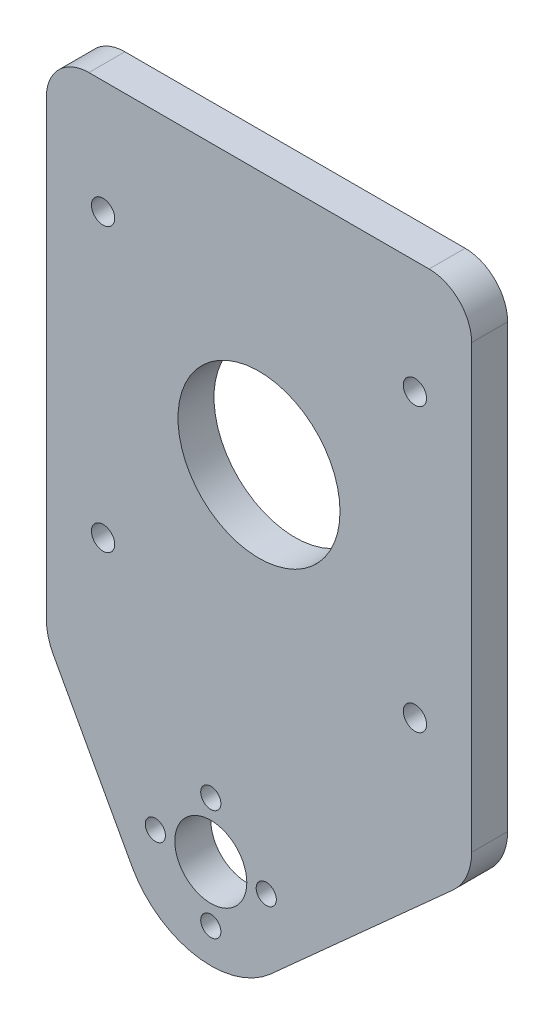
ISO-10303-21;
HEADER;
FILE_DESCRIPTION(('STEP AP214'),'2;1');
FILE_NAME('part.step','',(''),(''),'','','');
FILE_SCHEMA(('AUTOMOTIVE_DESIGN { 1 0 10303 214 1 1 1 1 }'));
ENDSEC;
DATA;
#1=APPLICATION_CONTEXT('core data for automotive mechanical design processes');
#2=APPLICATION_PROTOCOL_DEFINITION('international standard','automotive_design',2000,#1);
#3=PRODUCT_CONTEXT('',#1,'mechanical');
#4=PRODUCT('Part','Part','',(#3));
#5=PRODUCT_RELATED_PRODUCT_CATEGORY('part','',(#4));
#6=PRODUCT_DEFINITION_FORMATION('','',#4);
#7=PRODUCT_DEFINITION_CONTEXT('part definition',#1,'design');
#8=PRODUCT_DEFINITION('design','',#6,#7);
#9=PRODUCT_DEFINITION_SHAPE('','',#8);
#10=(LENGTH_UNIT() NAMED_UNIT(*) SI_UNIT(.MILLI.,.METRE.));
#11=(NAMED_UNIT(*) PLANE_ANGLE_UNIT() SI_UNIT($,.RADIAN.));
#12=(NAMED_UNIT(*) SI_UNIT($,.STERADIAN.) SOLID_ANGLE_UNIT());
#13=UNCERTAINTY_MEASURE_WITH_UNIT(LENGTH_MEASURE(1.E-05),#10,'distance_accuracy_value','');
#14=(GEOMETRIC_REPRESENTATION_CONTEXT(3) GLOBAL_UNCERTAINTY_ASSIGNED_CONTEXT((#13)) GLOBAL_UNIT_ASSIGNED_CONTEXT((#10,
#11,#12)) REPRESENTATION_CONTEXT('',''));
#15=CARTESIAN_POINT('',(0.,0.,0.));
#16=DIRECTION('',(0.,0.,1.));
#17=DIRECTION('',(1.,0.,0.));
#18=AXIS2_PLACEMENT_3D('',#15,#16,#17);
#19=CARTESIAN_POINT('',(101.166089346167,22.3971658936851,4.23333333333333));
#20=DIRECTION('',(0.,0.,-1.));
#21=DIRECTION('',(-1.,0.,0.));
#22=AXIS2_PLACEMENT_3D('',#19,#20,#21);
#23=PLANE('',#22);
#24=CARTESIAN_POINT('',(161.132756012834,29.0638325603517,4.23333333333333));
#25=DIRECTION('',(0.,0.,1.));
#26=DIRECTION('',(-1.,0.,0.));
#27=AXIS2_PLACEMENT_3D('',#24,#25,#26);
#28=CIRCLE('',#27,0.683333333333331);
#29=CARTESIAN_POINT('',(160.449422679501,29.0638325603517,4.23333333333333));
#30=VERTEX_POINT('',#29);
#31=EDGE_CURVE('E300',#30,#30,#28,.T.);
#32=ORIENTED_EDGE('',*,*,#31,.F.);
#33=EDGE_LOOP('',(#32));
#34=FACE_BOUND('',#33,.T.);
#35=CARTESIAN_POINT('',(142.799422679501,29.0638325603517,4.23333333333333));
#36=DIRECTION('',(0.,0.,1.));
#37=DIRECTION('',(-1.,0.,0.));
#38=AXIS2_PLACEMENT_3D('',#35,#36,#37);
#39=CIRCLE('',#38,0.683333333333336);
#40=CARTESIAN_POINT('',(142.116089346167,29.0638325603517,4.23333333333333));
#41=VERTEX_POINT('',#40);
#42=EDGE_CURVE('E304',#41,#41,#39,.T.);
#43=ORIENTED_EDGE('',*,*,#42,.F.);
#44=EDGE_LOOP('',(#43));
#45=FACE_BOUND('',#44,.T.);
#46=CARTESIAN_POINT('',(142.799422679501,45.6638325603517,4.23333333333333));
#47=DIRECTION('',(0.,0.,1.));
#48=DIRECTION('',(1.,0.,0.));
#49=AXIS2_PLACEMENT_3D('',#46,#47,#48);
#50=CIRCLE('',#49,0.683333333333337);
#51=CARTESIAN_POINT('',(143.482756012834,45.6638325603517,4.23333333333333));
#52=VERTEX_POINT('',#51);
#53=EDGE_CURVE('E299',#52,#52,#50,.T.);
#54=ORIENTED_EDGE('',*,*,#53,.F.);
#55=EDGE_LOOP('',(#54));
#56=FACE_BOUND('',#55,.T.);
#57=CARTESIAN_POINT('',(161.132756012834,45.6638325603517,4.23333333333333));
#58=DIRECTION('',(0.,0.,1.));
#59=DIRECTION('',(1.,0.,0.));
#60=AXIS2_PLACEMENT_3D('',#57,#58,#59);
#61=CIRCLE('',#60,0.683333333333331);
#62=CARTESIAN_POINT('',(161.816089346167,45.6638325603517,4.23333333333333));
#63=VERTEX_POINT('',#62);
#64=EDGE_CURVE('E236',#63,#63,#61,.T.);
#65=ORIENTED_EDGE('',*,*,#64,.F.);
#66=EDGE_LOOP('',(#65));
#67=FACE_BOUND('',#66,.T.);
#68=CARTESIAN_POINT('',(151.966089346167,37.3638325603517,4.23333333333333));
#69=DIRECTION('',(0.,0.,1.));
#70=DIRECTION('',(1.,0.,0.));
#71=AXIS2_PLACEMENT_3D('',#68,#69,#70);
#72=CIRCLE('',#71,4.7625);
#73=CARTESIAN_POINT('',(156.728589346167,37.3638325603517,4.23333333333333));
#74=VERTEX_POINT('',#73);
#75=EDGE_CURVE('E171',#74,#74,#72,.T.);
#76=ORIENTED_EDGE('',*,*,#75,.F.);
#77=EDGE_LOOP('',(#76));
#78=FACE_BOUND('',#77,.T.);
#79=DIRECTION('',(-1.,0.,0.));
#80=VECTOR('',#79,1.);
#81=CARTESIAN_POINT('',(101.166089346167,52.3304992270184,4.23333333333333));
#82=LINE('',#81,#80);
#83=CARTESIAN_POINT('',(161.966089346167,52.3304992270184,4.23333333333333));
#84=VERTEX_POINT('',#83);
#85=CARTESIAN_POINT('',(141.966089346167,52.3304992270184,4.23333333333333));
#86=VERTEX_POINT('',#85);
#87=EDGE_CURVE('E179',#84,#86,#82,.T.);
#88=ORIENTED_EDGE('',*,*,#87,.T.);
#89=CARTESIAN_POINT('',(141.966089346167,49.8304992270184,4.23333333333333));
#90=DIRECTION('',(0.,0.,-1.));
#91=DIRECTION('',(-1.,0.,0.));
#92=AXIS2_PLACEMENT_3D('',#89,#90,#91);
#93=CIRCLE('',#92,2.5);
#94=CARTESIAN_POINT('',(139.466089346167,49.8304992270184,4.23333333333333));
#95=VERTEX_POINT('',#94);
#96=EDGE_CURVE('E222',#86,#95,#93,.F.);
#97=ORIENTED_EDGE('',*,*,#96,.T.);
#98=DIRECTION('',(0.,1.,0.));
#99=VECTOR('',#98,1.);
#100=CARTESIAN_POINT('',(139.466089346167,22.3971658936851,4.23333333333333));
#101=LINE('',#100,#99);
#102=CARTESIAN_POINT('',(139.466089346167,23.2475370701385,4.23333333333333));
#103=VERTEX_POINT('',#102);
#104=EDGE_CURVE('E161',#103,#95,#101,.T.);
#105=ORIENTED_EDGE('',*,*,#104,.F.);
#106=CARTESIAN_POINT('',(142.799422679501,23.2475370701385,4.23333333333333));
#107=DIRECTION('',(0.,0.,-1.));
#108=DIRECTION('',(-1.,0.,0.));
#109=AXIS2_PLACEMENT_3D('',#106,#107,#108);
#110=CIRCLE('',#109,3.33333333333333);
#111=CARTESIAN_POINT('',(139.873455880521,21.6507185449515,4.23333333333333));
#112=VERTEX_POINT('',#111);
#113=EDGE_CURVE('E193',#103,#112,#110,.F.);
#114=ORIENTED_EDGE('',*,*,#113,.T.);
#115=DIRECTION('',(0.479045557556106,-0.877790039693867,0.));
#116=VECTOR('',#115,1.);
#117=CARTESIAN_POINT('',(139.466089346167,22.3971658936851,4.23333333333333));
#118=LINE('',#117,#116);
#119=CARTESIAN_POINT('',(144.487783719454,13.195549818284,4.23333333333333));
#120=VERTEX_POINT('',#119);
#121=EDGE_CURVE('E277',#112,#120,#118,.T.);
#122=ORIENTED_EDGE('',*,*,#121,.T.);
#123=CARTESIAN_POINT('',(149.132756012834,15.7304992270184,4.23333333333333));
#124=DIRECTION('',(0.,0.,1.));
#125=DIRECTION('',(1.,0.,0.));
#126=AXIS2_PLACEMENT_3D('',#123,#124,#125);
#127=CIRCLE('',#126,5.29166666666668);
#128=CARTESIAN_POINT('',(152.670089840437,11.794891840197,4.23333333333333));
#129=VERTEX_POINT('',#128);
#130=EDGE_CURVE('E146',#120,#129,#127,.T.);
#131=ORIENTED_EDGE('',*,*,#130,.T.);
#132=DIRECTION('',(0.743736829005616,0.668472534350269,0.));
#133=VECTOR('',#132,1.);
#134=CARTESIAN_POINT('',(164.466089346167,22.3971658936851,4.23333333333333));
#135=LINE('',#134,#133);
#136=CARTESIAN_POINT('',(163.360997794002,21.4039068244078,4.23333333333333));
#137=VERTEX_POINT('',#136);
#138=EDGE_CURVE('E258',#129,#137,#135,.T.);
#139=ORIENTED_EDGE('',*,*,#138,.T.);
#140=CARTESIAN_POINT('',(161.132756012834,23.8830295877599,4.23333333333333));
#141=DIRECTION('',(0.,0.,-1.));
#142=DIRECTION('',(-1.,0.,0.));
#143=AXIS2_PLACEMENT_3D('',#140,#141,#142);
#144=CIRCLE('',#143,3.33333333333333);
#145=CARTESIAN_POINT('',(164.466089346167,23.8830295877599,4.23333333333333));
#146=VERTEX_POINT('',#145);
#147=EDGE_CURVE('E190',#137,#146,#144,.F.);
#148=ORIENTED_EDGE('',*,*,#147,.T.);
#149=DIRECTION('',(0.,1.,0.));
#150=VECTOR('',#149,1.);
#151=CARTESIAN_POINT('',(164.466089346167,22.3971658936851,4.23333333333333));
#152=LINE('',#151,#150);
#153=CARTESIAN_POINT('',(164.466089346167,49.8304992270184,4.23333333333333));
#154=VERTEX_POINT('',#153);
#155=EDGE_CURVE('E156',#146,#154,#152,.T.);
#156=ORIENTED_EDGE('',*,*,#155,.T.);
#157=CARTESIAN_POINT('',(161.966089346167,49.8304992270184,4.23333333333333));
#158=DIRECTION('',(0.,0.,-1.));
#159=DIRECTION('',(-1.,0.,0.));
#160=AXIS2_PLACEMENT_3D('',#157,#158,#159);
#161=CIRCLE('',#160,2.5);
#162=EDGE_CURVE('E219',#154,#84,#161,.F.);
#163=ORIENTED_EDGE('',*,*,#162,.T.);
#164=EDGE_LOOP('',(#88,#97,#105,#114,#122,#131,#139,#148,#156,#163));
#165=FACE_BOUND('',#164,.T.);
#166=CARTESIAN_POINT('',(149.132756012834,18.9901658936851,4.23333333333333));
#167=DIRECTION('',(0.,0.,1.));
#168=DIRECTION('',(1.,0.,0.));
#169=AXIS2_PLACEMENT_3D('',#166,#167,#168);
#170=CIRCLE('',#169,0.592666666666659);
#171=CARTESIAN_POINT('',(149.725422679501,18.9901658936851,4.23333333333333));
#172=VERTEX_POINT('',#171);
#173=EDGE_CURVE('E273',#172,#172,#170,.T.);
#174=ORIENTED_EDGE('',*,*,#173,.F.);
#175=EDGE_LOOP('',(#174));
#176=FACE_BOUND('',#175,.T.);
#177=CARTESIAN_POINT('',(152.392422679501,15.7304992270184,4.23333333333333));
#178=DIRECTION('',(0.,0.,1.));
#179=DIRECTION('',(1.,0.,0.));
#180=AXIS2_PLACEMENT_3D('',#177,#178,#179);
#181=CIRCLE('',#180,0.592666666666669);
#182=CARTESIAN_POINT('',(152.985089346167,15.7304992270184,4.23333333333333));
#183=VERTEX_POINT('',#182);
#184=EDGE_CURVE('E278',#183,#183,#181,.T.);
#185=ORIENTED_EDGE('',*,*,#184,.F.);
#186=EDGE_LOOP('',(#185));
#187=FACE_BOUND('',#186,.T.);
#188=CARTESIAN_POINT('',(145.873089346167,15.7304992270184,4.23333333333333));
#189=DIRECTION('',(0.,0.,1.));
#190=DIRECTION('',(1.,0.,0.));
#191=AXIS2_PLACEMENT_3D('',#188,#189,#190);
#192=CIRCLE('',#191,0.592666666666669);
#193=CARTESIAN_POINT('',(146.465756012834,15.7304992270184,4.23333333333333));
#194=VERTEX_POINT('',#193);
#195=EDGE_CURVE('E282',#194,#194,#192,.T.);
#196=ORIENTED_EDGE('',*,*,#195,.F.);
#197=EDGE_LOOP('',(#196));
#198=FACE_BOUND('',#197,.T.);
#199=CARTESIAN_POINT('',(149.132756012834,12.4708325603517,4.23333333333333));
#200=DIRECTION('',(0.,0.,1.));
#201=DIRECTION('',(1.,0.,0.));
#202=AXIS2_PLACEMENT_3D('',#199,#200,#201);
#203=CIRCLE('',#202,0.592666666666669);
#204=CARTESIAN_POINT('',(149.725422679501,12.4708325603517,4.23333333333333));
#205=VERTEX_POINT('',#204);
#206=EDGE_CURVE('E152',#205,#205,#203,.T.);
#207=ORIENTED_EDGE('',*,*,#206,.F.);
#208=EDGE_LOOP('',(#207));
#209=FACE_BOUND('',#208,.T.);
#210=CARTESIAN_POINT('',(149.132756012834,15.7304992270184,4.23333333333333));
#211=DIRECTION('',(0.,0.,1.));
#212=DIRECTION('',(1.,0.,0.));
#213=AXIS2_PLACEMENT_3D('',#210,#211,#212);
#214=CIRCLE('',#213,2.11666666666666);
#215=CARTESIAN_POINT('',(151.249422679501,15.7304992270184,4.23333333333333));
#216=VERTEX_POINT('',#215);
#217=EDGE_CURVE('E148',#216,#216,#214,.T.);
#218=ORIENTED_EDGE('',*,*,#217,.F.);
#219=EDGE_LOOP('',(#218));
#220=FACE_BOUND('',#219,.T.);
#221=ADVANCED_FACE('F38',(#34,#45,#56,#67,#78,#165,#176,#187,#198,#209,#220),#23,.F.);
#222=CARTESIAN_POINT('',(101.166089346167,22.3971658936851,2.11666666666667));
#223=DIRECTION('',(0.,0.,-1.));
#224=DIRECTION('',(-1.,0.,0.));
#225=AXIS2_PLACEMENT_3D('',#222,#223,#224);
#226=PLANE('',#225);
#227=CARTESIAN_POINT('',(161.132756012834,29.0638325603517,2.11666666666667));
#228=DIRECTION('',(0.,0.,-1.));
#229=DIRECTION('',(-1.,0.,0.));
#230=AXIS2_PLACEMENT_3D('',#227,#228,#229);
#231=CIRCLE('',#230,0.683333333333331);
#232=CARTESIAN_POINT('',(160.449422679501,29.0638325603517,2.11666666666667));
#233=VERTEX_POINT('',#232);
#234=EDGE_CURVE('E42',#233,#233,#231,.T.);
#235=ORIENTED_EDGE('',*,*,#234,.F.);
#236=EDGE_LOOP('',(#235));
#237=FACE_BOUND('',#236,.T.);
#238=CARTESIAN_POINT('',(142.799422679501,29.0638325603517,2.11666666666667));
#239=DIRECTION('',(0.,0.,-1.));
#240=DIRECTION('',(-1.,0.,0.));
#241=AXIS2_PLACEMENT_3D('',#238,#239,#240);
#242=CIRCLE('',#241,0.683333333333336);
#243=CARTESIAN_POINT('',(142.116089346167,29.0638325603517,2.11666666666667));
#244=VERTEX_POINT('',#243);
#245=EDGE_CURVE('E239',#244,#244,#242,.T.);
#246=ORIENTED_EDGE('',*,*,#245,.F.);
#247=EDGE_LOOP('',(#246));
#248=FACE_BOUND('',#247,.T.);
#249=CARTESIAN_POINT('',(142.799422679501,45.6638325603517,2.11666666666667));
#250=DIRECTION('',(0.,0.,-1.));
#251=DIRECTION('',(-1.,0.,0.));
#252=AXIS2_PLACEMENT_3D('',#249,#250,#251);
#253=CIRCLE('',#252,0.683333333333337);
#254=CARTESIAN_POINT('',(142.116089346167,45.6638325603517,2.11666666666667));
#255=VERTEX_POINT('',#254);
#256=EDGE_CURVE('E235',#255,#255,#253,.T.);
#257=ORIENTED_EDGE('',*,*,#256,.F.);
#258=EDGE_LOOP('',(#257));
#259=FACE_BOUND('',#258,.T.);
#260=CARTESIAN_POINT('',(161.132756012834,45.6638325603517,2.11666666666667));
#261=DIRECTION('',(0.,0.,-1.));
#262=DIRECTION('',(-1.,0.,0.));
#263=AXIS2_PLACEMENT_3D('',#260,#261,#262);
#264=CIRCLE('',#263,0.683333333333331);
#265=CARTESIAN_POINT('',(160.449422679501,45.6638325603517,2.11666666666667));
#266=VERTEX_POINT('',#265);
#267=EDGE_CURVE('E231',#266,#266,#264,.T.);
#268=ORIENTED_EDGE('',*,*,#267,.F.);
#269=EDGE_LOOP('',(#268));
#270=FACE_BOUND('',#269,.T.);
#271=CARTESIAN_POINT('',(151.966089346167,37.3638325603517,2.11666666666667));
#272=DIRECTION('',(0.,0.,1.));
#273=DIRECTION('',(1.,0.,0.));
#274=AXIS2_PLACEMENT_3D('',#271,#272,#273);
#275=CIRCLE('',#274,4.7625);
#276=CARTESIAN_POINT('',(156.728589346167,37.3638325603517,2.11666666666667));
#277=VERTEX_POINT('',#276);
#278=EDGE_CURVE('E170',#277,#277,#275,.T.);
#279=ORIENTED_EDGE('',*,*,#278,.T.);
#280=EDGE_LOOP('',(#279));
#281=FACE_BOUND('',#280,.T.);
#282=DIRECTION('',(0.,-1.,0.));
#283=VECTOR('',#282,1.);
#284=CARTESIAN_POINT('',(139.466089346167,22.3971658936851,2.11666666666667));
#285=LINE('',#284,#283);
#286=CARTESIAN_POINT('',(139.466089346167,49.8304992270184,2.11666666666667));
#287=VERTEX_POINT('',#286);
#288=CARTESIAN_POINT('',(139.466089346167,23.2475370701385,2.11666666666667));
#289=VERTEX_POINT('',#288);
#290=EDGE_CURVE('E160',#287,#289,#285,.T.);
#291=ORIENTED_EDGE('',*,*,#290,.F.);
#292=CARTESIAN_POINT('',(141.966089346167,49.8304992270184,2.11666666666667));
#293=DIRECTION('',(0.,0.,-1.));
#294=DIRECTION('',(-1.,0.,0.));
#295=AXIS2_PLACEMENT_3D('',#292,#293,#294);
#296=CIRCLE('',#295,2.5);
#297=CARTESIAN_POINT('',(141.966089346167,52.3304992270184,2.11666666666667));
#298=VERTEX_POINT('',#297);
#299=EDGE_CURVE('E48',#287,#298,#296,.T.);
#300=ORIENTED_EDGE('',*,*,#299,.T.);
#301=DIRECTION('',(-1.,0.,0.));
#302=VECTOR('',#301,1.);
#303=CARTESIAN_POINT('',(101.166089346167,52.3304992270184,2.11666666666667));
#304=LINE('',#303,#302);
#305=CARTESIAN_POINT('',(161.966089346167,52.3304992270184,2.11666666666667));
#306=VERTEX_POINT('',#305);
#307=EDGE_CURVE('E175',#306,#298,#304,.T.);
#308=ORIENTED_EDGE('',*,*,#307,.F.);
#309=CARTESIAN_POINT('',(161.966089346167,49.8304992270184,2.11666666666667));
#310=DIRECTION('',(0.,0.,-1.));
#311=DIRECTION('',(-1.,0.,0.));
#312=AXIS2_PLACEMENT_3D('',#309,#310,#311);
#313=CIRCLE('',#312,2.5);
#314=CARTESIAN_POINT('',(164.466089346167,49.8304992270184,2.11666666666667));
#315=VERTEX_POINT('',#314);
#316=EDGE_CURVE('E56',#306,#315,#313,.T.);
#317=ORIENTED_EDGE('',*,*,#316,.T.);
#318=DIRECTION('',(0.,-1.,0.));
#319=VECTOR('',#318,1.);
#320=CARTESIAN_POINT('',(164.466089346167,22.3971658936851,2.11666666666667));
#321=LINE('',#320,#319);
#322=CARTESIAN_POINT('',(164.466089346167,23.8830295877599,2.11666666666667));
#323=VERTEX_POINT('',#322);
#324=EDGE_CURVE('E167',#315,#323,#321,.T.);
#325=ORIENTED_EDGE('',*,*,#324,.T.);
#326=CARTESIAN_POINT('',(161.132756012834,23.8830295877599,2.11666666666667));
#327=DIRECTION('',(0.,0.,-1.));
#328=DIRECTION('',(-1.,0.,0.));
#329=AXIS2_PLACEMENT_3D('',#326,#327,#328);
#330=CIRCLE('',#329,3.33333333333333);
#331=CARTESIAN_POINT('',(163.360997794002,21.4039068244078,2.11666666666667));
#332=VERTEX_POINT('',#331);
#333=EDGE_CURVE('E198',#323,#332,#330,.T.);
#334=ORIENTED_EDGE('',*,*,#333,.T.);
#335=DIRECTION('',(0.743736829005616,0.668472534350269,0.));
#336=VECTOR('',#335,1.);
#337=CARTESIAN_POINT('',(164.466089346167,22.3971658936851,2.11666666666667));
#338=LINE('',#337,#336);
#339=CARTESIAN_POINT('',(152.670089840437,11.794891840197,2.11666666666667));
#340=VERTEX_POINT('',#339);
#341=EDGE_CURVE('E139',#340,#332,#338,.T.);
#342=ORIENTED_EDGE('',*,*,#341,.F.);
#343=CARTESIAN_POINT('',(149.132756012834,15.7304992270184,2.11666666666667));
#344=DIRECTION('',(0.,0.,-1.));
#345=DIRECTION('',(-1.,0.,0.));
#346=AXIS2_PLACEMENT_3D('',#343,#344,#345);
#347=CIRCLE('',#346,5.29166666666668);
#348=CARTESIAN_POINT('',(144.487783719454,13.195549818284,2.11666666666667));
#349=VERTEX_POINT('',#348);
#350=EDGE_CURVE('E135',#349,#340,#347,.F.);
#351=ORIENTED_EDGE('',*,*,#350,.F.);
#352=DIRECTION('',(0.479045557556106,-0.877790039693867,0.));
#353=VECTOR('',#352,1.);
#354=CARTESIAN_POINT('',(139.466089346167,22.3971658936851,2.11666666666667));
#355=LINE('',#354,#353);
#356=CARTESIAN_POINT('',(139.873455880521,21.6507185449515,2.11666666666667));
#357=VERTEX_POINT('',#356);
#358=EDGE_CURVE('E120',#357,#349,#355,.T.);
#359=ORIENTED_EDGE('',*,*,#358,.F.);
#360=CARTESIAN_POINT('',(142.799422679501,23.2475370701385,2.11666666666667));
#361=DIRECTION('',(0.,0.,-1.));
#362=DIRECTION('',(-1.,0.,0.));
#363=AXIS2_PLACEMENT_3D('',#360,#361,#362);
#364=CIRCLE('',#363,3.33333333333333);
#365=EDGE_CURVE('E201',#357,#289,#364,.T.);
#366=ORIENTED_EDGE('',*,*,#365,.T.);
#367=EDGE_LOOP('',(#291,#300,#308,#317,#325,#334,#342,#351,#359,#366));
#368=FACE_BOUND('',#367,.T.);
#369=CARTESIAN_POINT('',(149.132756012834,12.4708325603517,2.11666666666667));
#370=DIRECTION('',(0.,0.,-1.));
#371=DIRECTION('',(-1.,0.,0.));
#372=AXIS2_PLACEMENT_3D('',#369,#370,#371);
#373=CIRCLE('',#372,0.592666666666669);
#374=CARTESIAN_POINT('',(148.540089346167,12.4708325603517,2.11666666666667));
#375=VERTEX_POINT('',#374);
#376=EDGE_CURVE('E253',#375,#375,#373,.F.);
#377=ORIENTED_EDGE('',*,*,#376,.T.);
#378=EDGE_LOOP('',(#377));
#379=FACE_BOUND('',#378,.T.);
#380=CARTESIAN_POINT('',(152.392422679501,15.7304992270184,2.11666666666667));
#381=DIRECTION('',(0.,0.,-1.));
#382=DIRECTION('',(-1.,0.,0.));
#383=AXIS2_PLACEMENT_3D('',#380,#381,#382);
#384=CIRCLE('',#383,0.592666666666669);
#385=CARTESIAN_POINT('',(151.799756012834,15.7304992270184,2.11666666666667));
#386=VERTEX_POINT('',#385);
#387=EDGE_CURVE('E257',#386,#386,#384,.F.);
#388=ORIENTED_EDGE('',*,*,#387,.T.);
#389=EDGE_LOOP('',(#388));
#390=FACE_BOUND('',#389,.T.);
#391=CARTESIAN_POINT('',(149.132756012834,18.9901658936851,2.11666666666667));
#392=DIRECTION('',(0.,0.,-1.));
#393=DIRECTION('',(-1.,0.,0.));
#394=AXIS2_PLACEMENT_3D('',#391,#392,#393);
#395=CIRCLE('',#394,0.592666666666659);
#396=CARTESIAN_POINT('',(148.540089346167,18.9901658936851,2.11666666666667));
#397=VERTEX_POINT('',#396);
#398=EDGE_CURVE('E262',#397,#397,#395,.F.);
#399=ORIENTED_EDGE('',*,*,#398,.T.);
#400=EDGE_LOOP('',(#399));
#401=FACE_BOUND('',#400,.T.);
#402=CARTESIAN_POINT('',(145.873089346167,15.7304992270184,2.11666666666667));
#403=DIRECTION('',(0.,0.,-1.));
#404=DIRECTION('',(-1.,0.,0.));
#405=AXIS2_PLACEMENT_3D('',#402,#403,#404);
#406=CIRCLE('',#405,0.592666666666669);
#407=CARTESIAN_POINT('',(145.280422679501,15.7304992270184,2.11666666666667));
#408=VERTEX_POINT('',#407);
#409=EDGE_CURVE('E266',#408,#408,#406,.F.);
#410=ORIENTED_EDGE('',*,*,#409,.T.);
#411=EDGE_LOOP('',(#410));
#412=FACE_BOUND('',#411,.T.);
#413=CARTESIAN_POINT('',(149.132756012834,15.7304992270184,2.11666666666667));
#414=DIRECTION('',(0.,0.,-1.));
#415=DIRECTION('',(-1.,0.,0.));
#416=AXIS2_PLACEMENT_3D('',#413,#414,#415);
#417=CIRCLE('',#416,2.11666666666666);
#418=CARTESIAN_POINT('',(147.016089346167,15.7304992270184,2.11666666666667));
#419=VERTEX_POINT('',#418);
#420=EDGE_CURVE('E164',#419,#419,#417,.F.);
#421=ORIENTED_EDGE('',*,*,#420,.T.);
#422=EDGE_LOOP('',(#421));
#423=FACE_BOUND('',#422,.T.);
#424=ADVANCED_FACE('F136',(#237,#248,#259,#270,#281,#368,#379,#390,#401,#412,#423),#226,.T.);
#425=CARTESIAN_POINT('',(101.166089346167,52.3304992270184,4.23333333333333));
#426=DIRECTION('',(0.,-1.,0.));
#427=DIRECTION('',(0.,0.,-1.));
#428=AXIS2_PLACEMENT_3D('',#425,#426,#427);
#429=PLANE('',#428);
#430=ORIENTED_EDGE('',*,*,#307,.T.);
#431=DIRECTION('',(0.,0.,1.));
#432=VECTOR('',#431,1.);
#433=CARTESIAN_POINT('',(141.966089346167,52.3304992270184,4.23333333333333));
#434=LINE('',#433,#432);
#435=EDGE_CURVE('E215',#298,#86,#434,.T.);
#436=ORIENTED_EDGE('',*,*,#435,.T.);
#437=ORIENTED_EDGE('',*,*,#87,.F.);
#438=DIRECTION('',(0.,0.,1.));
#439=VECTOR('',#438,1.);
#440=CARTESIAN_POINT('',(161.966089346167,52.3304992270184,2.11666666666667));
#441=LINE('',#440,#439);
#442=EDGE_CURVE('E212',#84,#306,#441,.F.);
#443=ORIENTED_EDGE('',*,*,#442,.T.);
#444=EDGE_LOOP('',(#430,#436,#437,#443));
#445=FACE_BOUND('',#444,.T.);
#446=ADVANCED_FACE('F342',(#445),#429,.F.);
#447=CARTESIAN_POINT('',(151.966089346167,37.3638325603517,4.23333333333333));
#448=DIRECTION('',(0.,0.,-1.));
#449=DIRECTION('',(-1.,0.,0.));
#450=AXIS2_PLACEMENT_3D('',#447,#448,#449);
#451=CYLINDRICAL_SURFACE('',#450,4.7625);
#452=ORIENTED_EDGE('',*,*,#75,.T.);
#453=EDGE_LOOP('',(#452));
#454=FACE_BOUND('',#453,.T.);
#455=ORIENTED_EDGE('',*,*,#278,.F.);
#456=EDGE_LOOP('',(#455));
#457=FACE_BOUND('',#456,.T.);
#458=ADVANCED_FACE('F348',(#454,#457),#451,.F.);
#459=CARTESIAN_POINT('',(139.466089346167,22.3971658936851,0.900000000000001));
#460=DIRECTION('',(1.,0.,0.));
#461=DIRECTION('',(0.,0.,-1.));
#462=AXIS2_PLACEMENT_3D('',#459,#460,#461);
#463=PLANE('',#462);
#464=ORIENTED_EDGE('',*,*,#104,.T.);
#465=DIRECTION('',(0.,0.,1.));
#466=VECTOR('',#465,1.);
#467=CARTESIAN_POINT('',(139.466089346167,49.8304992270184,0.900000000000001));
#468=LINE('',#467,#466);
#469=EDGE_CURVE('E64',#95,#287,#468,.F.);
#470=ORIENTED_EDGE('',*,*,#469,.T.);
#471=ORIENTED_EDGE('',*,*,#290,.T.);
#472=DIRECTION('',(0.,0.,1.));
#473=VECTOR('',#472,1.);
#474=CARTESIAN_POINT('',(139.466089346167,23.2475370701385,4.23333333333333));
#475=LINE('',#474,#473);
#476=EDGE_CURVE('E183',#289,#103,#475,.T.);
#477=ORIENTED_EDGE('',*,*,#476,.T.);
#478=EDGE_LOOP('',(#464,#470,#471,#477));
#479=FACE_BOUND('',#478,.T.);
#480=ADVANCED_FACE('F384',(#479),#463,.F.);
#481=CARTESIAN_POINT('',(164.466089346167,22.3971658936851,0.900000000000001));
#482=DIRECTION('',(1.,0.,0.));
#483=DIRECTION('',(0.,0.,-1.));
#484=AXIS2_PLACEMENT_3D('',#481,#482,#483);
#485=PLANE('',#484);
#486=ORIENTED_EDGE('',*,*,#324,.F.);
#487=DIRECTION('',(0.,0.,1.));
#488=VECTOR('',#487,1.);
#489=CARTESIAN_POINT('',(164.466089346167,49.8304992270184,4.23333333333333));
#490=LINE('',#489,#488);
#491=EDGE_CURVE('E11',#315,#154,#490,.T.);
#492=ORIENTED_EDGE('',*,*,#491,.T.);
#493=ORIENTED_EDGE('',*,*,#155,.F.);
#494=DIRECTION('',(0.,0.,1.));
#495=VECTOR('',#494,1.);
#496=CARTESIAN_POINT('',(164.466089346167,23.8830295877599,0.900000000000001));
#497=LINE('',#496,#495);
#498=EDGE_CURVE('E208',#146,#323,#497,.F.);
#499=ORIENTED_EDGE('',*,*,#498,.T.);
#500=EDGE_LOOP('',(#486,#492,#493,#499));
#501=FACE_BOUND('',#500,.T.);
#502=ADVANCED_FACE('F376',(#501),#485,.T.);
#503=CARTESIAN_POINT('',(164.466089346167,22.3971658936851,-25.5961775776745));
#504=DIRECTION('',(0.668472534350269,-0.743736829005616,0.));
#505=DIRECTION('',(0.743736829005616,0.668472534350269,0.));
#506=AXIS2_PLACEMENT_3D('',#503,#504,#505);
#507=PLANE('',#506);
#508=ORIENTED_EDGE('',*,*,#341,.T.);
#509=DIRECTION('',(0.,0.,1.));
#510=VECTOR('',#509,1.);
#511=CARTESIAN_POINT('',(163.360997794002,21.4039068244078,-25.5961775776745));
#512=LINE('',#511,#510);
#513=EDGE_CURVE('E204',#332,#137,#512,.T.);
#514=ORIENTED_EDGE('',*,*,#513,.T.);
#515=ORIENTED_EDGE('',*,*,#138,.F.);
#516=DIRECTION('',(0.,0.,1.));
#517=VECTOR('',#516,1.);
#518=CARTESIAN_POINT('',(152.670089840437,11.794891840197,-25.5961775776745));
#519=LINE('',#518,#517);
#520=EDGE_CURVE('E132',#340,#129,#519,.T.);
#521=ORIENTED_EDGE('',*,*,#520,.F.);
#522=EDGE_LOOP('',(#508,#514,#515,#521));
#523=FACE_BOUND('',#522,.T.);
#524=ADVANCED_FACE('F380',(#523),#507,.T.);
#525=CARTESIAN_POINT('',(149.132756012834,15.7304992270184,-25.5961775776745));
#526=DIRECTION('',(0.,0.,1.));
#527=DIRECTION('',(1.,0.,0.));
#528=AXIS2_PLACEMENT_3D('',#525,#526,#527);
#529=CYLINDRICAL_SURFACE('',#528,5.29166666666668);
#530=DIRECTION('',(0.,0.,1.));
#531=VECTOR('',#530,1.);
#532=CARTESIAN_POINT('',(144.487783719454,13.195549818284,-25.5961775776745));
#533=LINE('',#532,#531);
#534=EDGE_CURVE('E125',#349,#120,#533,.T.);
#535=ORIENTED_EDGE('',*,*,#534,.F.);
#536=ORIENTED_EDGE('',*,*,#350,.T.);
#537=ORIENTED_EDGE('',*,*,#520,.T.);
#538=ORIENTED_EDGE('',*,*,#130,.F.);
#539=EDGE_LOOP('',(#535,#536,#537,#538));
#540=FACE_BOUND('',#539,.T.);
#541=ADVANCED_FACE('F144',(#540),#529,.T.);
#542=CARTESIAN_POINT('',(139.466089346167,22.3971658936851,-25.5961775776745));
#543=DIRECTION('',(-0.877790039693867,-0.479045557556106,0.));
#544=DIRECTION('',(0.479045557556106,-0.877790039693867,0.));
#545=AXIS2_PLACEMENT_3D('',#542,#543,#544);
#546=PLANE('',#545);
#547=ORIENTED_EDGE('',*,*,#121,.F.);
#548=DIRECTION('',(0.,0.,1.));
#549=VECTOR('',#548,1.);
#550=CARTESIAN_POINT('',(139.873455880521,21.6507185449515,2.11666666666667));
#551=LINE('',#550,#549);
#552=EDGE_CURVE('E128',#112,#357,#551,.F.);
#553=ORIENTED_EDGE('',*,*,#552,.T.);
#554=ORIENTED_EDGE('',*,*,#358,.T.);
#555=ORIENTED_EDGE('',*,*,#534,.T.);
#556=EDGE_LOOP('',(#547,#553,#554,#555));
#557=FACE_BOUND('',#556,.T.);
#558=ADVANCED_FACE('F123',(#557),#546,.T.);
#559=CARTESIAN_POINT('',(149.132756012834,15.7304992270184,-25.5961775776745));
#560=DIRECTION('',(0.,0.,1.));
#561=DIRECTION('',(1.,0.,0.));
#562=AXIS2_PLACEMENT_3D('',#559,#560,#561);
#563=CYLINDRICAL_SURFACE('',#562,2.11666666666666);
#564=ORIENTED_EDGE('',*,*,#217,.T.);
#565=EDGE_LOOP('',(#564));
#566=FACE_BOUND('',#565,.T.);
#567=ORIENTED_EDGE('',*,*,#420,.F.);
#568=EDGE_LOOP('',(#567));
#569=FACE_BOUND('',#568,.T.);
#570=ADVANCED_FACE('F334',(#566,#569),#563,.F.);
#571=CARTESIAN_POINT('',(149.132756012834,12.4708325603517,-25.5961775776745));
#572=DIRECTION('',(0.,0.,1.));
#573=DIRECTION('',(1.,0.,0.));
#574=AXIS2_PLACEMENT_3D('',#571,#572,#573);
#575=CYLINDRICAL_SURFACE('',#574,0.592666666666669);
#576=ORIENTED_EDGE('',*,*,#206,.T.);
#577=EDGE_LOOP('',(#576));
#578=FACE_BOUND('',#577,.T.);
#579=ORIENTED_EDGE('',*,*,#376,.F.);
#580=EDGE_LOOP('',(#579));
#581=FACE_BOUND('',#580,.T.);
#582=ADVANCED_FACE('F337',(#578,#581),#575,.F.);
#583=CARTESIAN_POINT('',(145.873089346167,15.7304992270184,-25.5961775776745));
#584=DIRECTION('',(0.,0.,1.));
#585=DIRECTION('',(1.,0.,0.));
#586=AXIS2_PLACEMENT_3D('',#583,#584,#585);
#587=CYLINDRICAL_SURFACE('',#586,0.592666666666669);
#588=ORIENTED_EDGE('',*,*,#195,.T.);
#589=EDGE_LOOP('',(#588));
#590=FACE_BOUND('',#589,.T.);
#591=ORIENTED_EDGE('',*,*,#409,.F.);
#592=EDGE_LOOP('',(#591));
#593=FACE_BOUND('',#592,.T.);
#594=ADVANCED_FACE('F400',(#590,#593),#587,.F.);
#595=CARTESIAN_POINT('',(152.392422679501,15.7304992270184,-25.5961775776745));
#596=DIRECTION('',(0.,0.,1.));
#597=DIRECTION('',(1.,0.,0.));
#598=AXIS2_PLACEMENT_3D('',#595,#596,#597);
#599=CYLINDRICAL_SURFACE('',#598,0.592666666666669);
#600=ORIENTED_EDGE('',*,*,#184,.T.);
#601=EDGE_LOOP('',(#600));
#602=FACE_BOUND('',#601,.T.);
#603=ORIENTED_EDGE('',*,*,#387,.F.);
#604=EDGE_LOOP('',(#603));
#605=FACE_BOUND('',#604,.T.);
#606=ADVANCED_FACE('F396',(#602,#605),#599,.F.);
#607=CARTESIAN_POINT('',(149.132756012834,18.9901658936851,-25.5961775776745));
#608=DIRECTION('',(0.,0.,1.));
#609=DIRECTION('',(1.,0.,0.));
#610=AXIS2_PLACEMENT_3D('',#607,#608,#609);
#611=CYLINDRICAL_SURFACE('',#610,0.592666666666659);
#612=ORIENTED_EDGE('',*,*,#173,.T.);
#613=EDGE_LOOP('',(#612));
#614=FACE_BOUND('',#613,.T.);
#615=ORIENTED_EDGE('',*,*,#398,.F.);
#616=EDGE_LOOP('',(#615));
#617=FACE_BOUND('',#616,.T.);
#618=ADVANCED_FACE('F358',(#614,#617),#611,.F.);
#619=CARTESIAN_POINT('',(142.799422679501,23.2475370701385,0.900000000000001));
#620=DIRECTION('',(0.,0.,-1.));
#621=DIRECTION('',(-1.,0.,0.));
#622=AXIS2_PLACEMENT_3D('',#619,#620,#621);
#623=CYLINDRICAL_SURFACE('',#622,3.33333333333333);
#624=ORIENTED_EDGE('',*,*,#365,.F.);
#625=ORIENTED_EDGE('',*,*,#552,.F.);
#626=ORIENTED_EDGE('',*,*,#113,.F.);
#627=ORIENTED_EDGE('',*,*,#476,.F.);
#628=EDGE_LOOP('',(#624,#625,#626,#627));
#629=FACE_BOUND('',#628,.T.);
#630=ADVANCED_FACE('F354',(#629),#623,.T.);
#631=CARTESIAN_POINT('',(161.132756012834,23.8830295877599,-25.5961775776745));
#632=DIRECTION('',(0.,0.,1.));
#633=DIRECTION('',(1.,0.,0.));
#634=AXIS2_PLACEMENT_3D('',#631,#632,#633);
#635=CYLINDRICAL_SURFACE('',#634,3.33333333333333);
#636=ORIENTED_EDGE('',*,*,#333,.F.);
#637=ORIENTED_EDGE('',*,*,#498,.F.);
#638=ORIENTED_EDGE('',*,*,#147,.F.);
#639=ORIENTED_EDGE('',*,*,#513,.F.);
#640=EDGE_LOOP('',(#636,#637,#638,#639));
#641=FACE_BOUND('',#640,.T.);
#642=ADVANCED_FACE('F357',(#641),#635,.T.);
#643=CARTESIAN_POINT('',(141.966089346167,49.8304992270184,4.23333333333333));
#644=DIRECTION('',(0.,0.,1.));
#645=DIRECTION('',(1.,0.,0.));
#646=AXIS2_PLACEMENT_3D('',#643,#644,#645);
#647=CYLINDRICAL_SURFACE('',#646,2.5);
#648=ORIENTED_EDGE('',*,*,#299,.F.);
#649=ORIENTED_EDGE('',*,*,#469,.F.);
#650=ORIENTED_EDGE('',*,*,#96,.F.);
#651=ORIENTED_EDGE('',*,*,#435,.F.);
#652=EDGE_LOOP('',(#648,#649,#650,#651));
#653=FACE_BOUND('',#652,.T.);
#654=ADVANCED_FACE('F361',(#653),#647,.T.);
#655=CARTESIAN_POINT('',(161.966089346167,49.8304992270184,0.900000000000001));
#656=DIRECTION('',(0.,0.,-1.));
#657=DIRECTION('',(-1.,0.,0.));
#658=AXIS2_PLACEMENT_3D('',#655,#656,#657);
#659=CYLINDRICAL_SURFACE('',#658,2.5);
#660=ORIENTED_EDGE('',*,*,#316,.F.);
#661=ORIENTED_EDGE('',*,*,#442,.F.);
#662=ORIENTED_EDGE('',*,*,#162,.F.);
#663=ORIENTED_EDGE('',*,*,#491,.F.);
#664=EDGE_LOOP('',(#660,#661,#662,#663));
#665=FACE_BOUND('',#664,.T.);
#666=ADVANCED_FACE('F40',(#665),#659,.T.);
#667=CARTESIAN_POINT('',(161.132756012834,45.6638325603517,0.900000000000001));
#668=DIRECTION('',(0.,0.,1.));
#669=DIRECTION('',(1.,0.,0.));
#670=AXIS2_PLACEMENT_3D('',#667,#668,#669);
#671=CYLINDRICAL_SURFACE('',#670,0.683333333333331);
#672=ORIENTED_EDGE('',*,*,#267,.T.);
#673=EDGE_LOOP('',(#672));
#674=FACE_BOUND('',#673,.T.);
#675=ORIENTED_EDGE('',*,*,#64,.T.);
#676=EDGE_LOOP('',(#675));
#677=FACE_BOUND('',#676,.T.);
#678=ADVANCED_FACE('F368',(#674,#677),#671,.F.);
#679=CARTESIAN_POINT('',(142.799422679501,45.6638325603517,0.900000000000001));
#680=DIRECTION('',(0.,0.,1.));
#681=DIRECTION('',(1.,0.,0.));
#682=AXIS2_PLACEMENT_3D('',#679,#680,#681);
#683=CYLINDRICAL_SURFACE('',#682,0.683333333333337);
#684=ORIENTED_EDGE('',*,*,#256,.T.);
#685=EDGE_LOOP('',(#684));
#686=FACE_BOUND('',#685,.T.);
#687=ORIENTED_EDGE('',*,*,#53,.T.);
#688=EDGE_LOOP('',(#687));
#689=FACE_BOUND('',#688,.T.);
#690=ADVANCED_FACE('F312',(#686,#689),#683,.F.);
#691=CARTESIAN_POINT('',(142.799422679501,29.0638325603517,0.900000000000001));
#692=DIRECTION('',(0.,0.,1.));
#693=DIRECTION('',(1.,0.,0.));
#694=AXIS2_PLACEMENT_3D('',#691,#692,#693);
#695=CYLINDRICAL_SURFACE('',#694,0.683333333333336);
#696=ORIENTED_EDGE('',*,*,#245,.T.);
#697=EDGE_LOOP('',(#696));
#698=FACE_BOUND('',#697,.T.);
#699=ORIENTED_EDGE('',*,*,#42,.T.);
#700=EDGE_LOOP('',(#699));
#701=FACE_BOUND('',#700,.T.);
#702=ADVANCED_FACE('F420',(#698,#701),#695,.F.);
#703=CARTESIAN_POINT('',(161.132756012834,29.0638325603517,0.900000000000001));
#704=DIRECTION('',(0.,0.,1.));
#705=DIRECTION('',(1.,0.,0.));
#706=AXIS2_PLACEMENT_3D('',#703,#704,#705);
#707=CYLINDRICAL_SURFACE('',#706,0.683333333333331);
#708=ORIENTED_EDGE('',*,*,#234,.T.);
#709=EDGE_LOOP('',(#708));
#710=FACE_BOUND('',#709,.T.);
#711=ORIENTED_EDGE('',*,*,#31,.T.);
#712=EDGE_LOOP('',(#711));
#713=FACE_BOUND('',#712,.T.);
#714=ADVANCED_FACE('F417',(#710,#713),#707,.F.);
#715=CLOSED_SHELL('',(#221,#424,#446,#458,#480,#502,#524,#541,#558,#570,#582,#594,#606,#618,
#630,#642,#654,#666,#678,#690,#702,#714));
#716=MANIFOLD_SOLID_BREP('B2',#715);
#717=ADVANCED_BREP_SHAPE_REPRESENTATION('',(#18,#716),#14);
#718=SHAPE_DEFINITION_REPRESENTATION(#9,#717);
ENDSEC;
END-ISO-10303-21;
